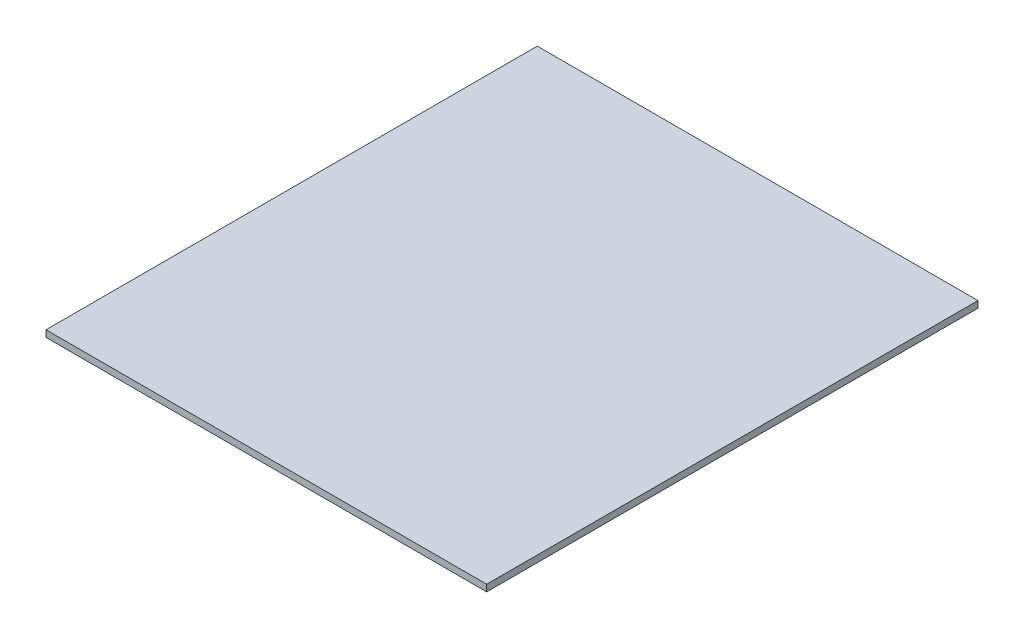
ISO-10303-21;
HEADER;
FILE_DESCRIPTION(('STEP AP214'),'2;1');
FILE_NAME('part.step','',(''),(''),'','','');
FILE_SCHEMA(('AUTOMOTIVE_DESIGN { 1 0 10303 214 1 1 1 1 }'));
ENDSEC;
DATA;
#1=APPLICATION_CONTEXT('core data for automotive mechanical design processes');
#2=APPLICATION_PROTOCOL_DEFINITION('international standard','automotive_design',2000,#1);
#3=PRODUCT_CONTEXT('',#1,'mechanical');
#4=PRODUCT('Part','Part','',(#3));
#5=PRODUCT_RELATED_PRODUCT_CATEGORY('part','',(#4));
#6=PRODUCT_DEFINITION_FORMATION('','',#4);
#7=PRODUCT_DEFINITION_CONTEXT('part definition',#1,'design');
#8=PRODUCT_DEFINITION('design','',#6,#7);
#9=PRODUCT_DEFINITION_SHAPE('','',#8);
#10=(LENGTH_UNIT() NAMED_UNIT(*) SI_UNIT(.MILLI.,.METRE.));
#11=(NAMED_UNIT(*) PLANE_ANGLE_UNIT() SI_UNIT($,.RADIAN.));
#12=(NAMED_UNIT(*) SI_UNIT($,.STERADIAN.) SOLID_ANGLE_UNIT());
#13=UNCERTAINTY_MEASURE_WITH_UNIT(LENGTH_MEASURE(1.E-05),#10,'distance_accuracy_value','');
#14=(GEOMETRIC_REPRESENTATION_CONTEXT(3) GLOBAL_UNCERTAINTY_ASSIGNED_CONTEXT((#13)) GLOBAL_UNIT_ASSIGNED_CONTEXT((#10,
#11,#12)) REPRESENTATION_CONTEXT('',''));
#15=CARTESIAN_POINT('',(0.,0.,0.));
#16=DIRECTION('',(0.,0.,1.));
#17=DIRECTION('',(1.,0.,0.));
#18=AXIS2_PLACEMENT_3D('',#15,#16,#17);
#19=CARTESIAN_POINT('',(331.,-10.,369.));
#20=DIRECTION('',(1.,0.,0.));
#21=DIRECTION('',(0.,0.,-1.));
#22=AXIS2_PLACEMENT_3D('',#19,#20,#21);
#23=PLANE('',#22);
#24=DIRECTION('',(0.,0.,-1.));
#25=VECTOR('',#24,1.);
#26=CARTESIAN_POINT('',(331.,0.,369.));
#27=LINE('',#26,#25);
#28=CARTESIAN_POINT('',(331.,0.,369.));
#29=VERTEX_POINT('',#28);
#30=CARTESIAN_POINT('',(331.,0.,-369.));
#31=VERTEX_POINT('',#30);
#32=EDGE_CURVE('E97',#29,#31,#27,.T.);
#33=ORIENTED_EDGE('',*,*,#32,.F.);
#34=DIRECTION('',(0.,1.,0.));
#35=VECTOR('',#34,1.);
#36=CARTESIAN_POINT('',(331.,-10.,369.));
#37=LINE('',#36,#35);
#38=CARTESIAN_POINT('',(331.,-10.,369.));
#39=VERTEX_POINT('',#38);
#40=EDGE_CURVE('E11',#39,#29,#37,.T.);
#41=ORIENTED_EDGE('',*,*,#40,.F.);
#42=DIRECTION('',(0.,0.,-1.));
#43=VECTOR('',#42,1.);
#44=CARTESIAN_POINT('',(331.,-10.,369.));
#45=LINE('',#44,#43);
#46=CARTESIAN_POINT('',(331.,-10.,-369.));
#47=VERTEX_POINT('',#46);
#48=EDGE_CURVE('E91',#39,#47,#45,.T.);
#49=ORIENTED_EDGE('',*,*,#48,.T.);
#50=DIRECTION('',(0.,1.,0.));
#51=VECTOR('',#50,1.);
#52=CARTESIAN_POINT('',(331.,-10.,-369.));
#53=LINE('',#52,#51);
#54=EDGE_CURVE('E36',#47,#31,#53,.T.);
#55=ORIENTED_EDGE('',*,*,#54,.T.);
#56=EDGE_LOOP('',(#33,#41,#49,#55));
#57=FACE_BOUND('',#56,.T.);
#58=ADVANCED_FACE('F33',(#57),#23,.T.);
#59=CARTESIAN_POINT('',(-331.,-10.,369.));
#60=DIRECTION('',(0.,0.,1.));
#61=DIRECTION('',(1.,0.,0.));
#62=AXIS2_PLACEMENT_3D('',#59,#60,#61);
#63=PLANE('',#62);
#64=DIRECTION('',(1.,0.,0.));
#65=VECTOR('',#64,1.);
#66=CARTESIAN_POINT('',(-331.,0.,369.));
#67=LINE('',#66,#65);
#68=CARTESIAN_POINT('',(-331.,0.,369.));
#69=VERTEX_POINT('',#68);
#70=EDGE_CURVE('E93',#69,#29,#67,.T.);
#71=ORIENTED_EDGE('',*,*,#70,.F.);
#72=DIRECTION('',(0.,1.,0.));
#73=VECTOR('',#72,1.);
#74=CARTESIAN_POINT('',(-331.,-10.,369.));
#75=LINE('',#74,#73);
#76=CARTESIAN_POINT('',(-331.,-10.,369.));
#77=VERTEX_POINT('',#76);
#78=EDGE_CURVE('E42',#77,#69,#75,.T.);
#79=ORIENTED_EDGE('',*,*,#78,.F.);
#80=DIRECTION('',(1.,0.,0.));
#81=VECTOR('',#80,1.);
#82=CARTESIAN_POINT('',(-331.,-10.,369.));
#83=LINE('',#82,#81);
#84=EDGE_CURVE('E88',#77,#39,#83,.T.);
#85=ORIENTED_EDGE('',*,*,#84,.T.);
#86=ORIENTED_EDGE('',*,*,#40,.T.);
#87=EDGE_LOOP('',(#71,#79,#85,#86));
#88=FACE_BOUND('',#87,.T.);
#89=ADVANCED_FACE('F107',(#88),#63,.T.);
#90=CARTESIAN_POINT('',(-331.,-10.,369.));
#91=DIRECTION('',(-1.,0.,0.));
#92=DIRECTION('',(0.,0.,1.));
#93=AXIS2_PLACEMENT_3D('',#90,#91,#92);
#94=PLANE('',#93);
#95=DIRECTION('',(0.,0.,1.));
#96=VECTOR('',#95,1.);
#97=CARTESIAN_POINT('',(-331.,0.,369.));
#98=LINE('',#97,#96);
#99=CARTESIAN_POINT('',(-331.,0.,-369.));
#100=VERTEX_POINT('',#99);
#101=EDGE_CURVE('E83',#100,#69,#98,.T.);
#102=ORIENTED_EDGE('',*,*,#101,.F.);
#103=DIRECTION('',(0.,1.,0.));
#104=VECTOR('',#103,1.);
#105=CARTESIAN_POINT('',(-331.,-10.,-369.));
#106=LINE('',#105,#104);
#107=CARTESIAN_POINT('',(-331.,-10.,-369.));
#108=VERTEX_POINT('',#107);
#109=EDGE_CURVE('E78',#108,#100,#106,.T.);
#110=ORIENTED_EDGE('',*,*,#109,.F.);
#111=DIRECTION('',(0.,0.,1.));
#112=VECTOR('',#111,1.);
#113=CARTESIAN_POINT('',(-331.,-10.,369.));
#114=LINE('',#113,#112);
#115=EDGE_CURVE('E81',#108,#77,#114,.T.);
#116=ORIENTED_EDGE('',*,*,#115,.T.);
#117=ORIENTED_EDGE('',*,*,#78,.T.);
#118=EDGE_LOOP('',(#102,#110,#116,#117));
#119=FACE_BOUND('',#118,.T.);
#120=ADVANCED_FACE('F80',(#119),#94,.T.);
#121=CARTESIAN_POINT('',(-331.,-10.,-369.));
#122=DIRECTION('',(0.,0.,-1.));
#123=DIRECTION('',(-1.,0.,0.));
#124=AXIS2_PLACEMENT_3D('',#121,#122,#123);
#125=PLANE('',#124);
#126=DIRECTION('',(-1.,0.,0.));
#127=VECTOR('',#126,1.);
#128=CARTESIAN_POINT('',(-331.,0.,-369.));
#129=LINE('',#128,#127);
#130=EDGE_CURVE('E100',#31,#100,#129,.T.);
#131=ORIENTED_EDGE('',*,*,#130,.F.);
#132=ORIENTED_EDGE('',*,*,#54,.F.);
#133=DIRECTION('',(-1.,0.,0.));
#134=VECTOR('',#133,1.);
#135=CARTESIAN_POINT('',(-331.,-10.,-369.));
#136=LINE('',#135,#134);
#137=EDGE_CURVE('E87',#47,#108,#136,.T.);
#138=ORIENTED_EDGE('',*,*,#137,.T.);
#139=ORIENTED_EDGE('',*,*,#109,.T.);
#140=EDGE_LOOP('',(#131,#132,#138,#139));
#141=FACE_BOUND('',#140,.T.);
#142=ADVANCED_FACE('F90',(#141),#125,.T.);
#143=CARTESIAN_POINT('',(0.,-10.,0.));
#144=DIRECTION('',(0.,-1.,0.));
#145=DIRECTION('',(0.,0.,-1.));
#146=AXIS2_PLACEMENT_3D('',#143,#144,#145);
#147=PLANE('',#146);
#148=ORIENTED_EDGE('',*,*,#48,.F.);
#149=ORIENTED_EDGE('',*,*,#84,.F.);
#150=ORIENTED_EDGE('',*,*,#115,.F.);
#151=ORIENTED_EDGE('',*,*,#137,.F.);
#152=EDGE_LOOP('',(#148,#149,#150,#151));
#153=FACE_BOUND('',#152,.T.);
#154=ADVANCED_FACE('F86',(#153),#147,.T.);
#155=CARTESIAN_POINT('',(0.,0.,0.));
#156=DIRECTION('',(0.,-1.,0.));
#157=DIRECTION('',(0.,0.,-1.));
#158=AXIS2_PLACEMENT_3D('',#155,#156,#157);
#159=PLANE('',#158);
#160=ORIENTED_EDGE('',*,*,#32,.T.);
#161=ORIENTED_EDGE('',*,*,#130,.T.);
#162=ORIENTED_EDGE('',*,*,#101,.T.);
#163=ORIENTED_EDGE('',*,*,#70,.T.);
#164=EDGE_LOOP('',(#160,#161,#162,#163));
#165=FACE_BOUND('',#164,.T.);
#166=ADVANCED_FACE('F106',(#165),#159,.F.);
#167=CLOSED_SHELL('',(#58,#89,#120,#142,#154,#166));
#168=MANIFOLD_SOLID_BREP('B2',#167);
#169=ADVANCED_BREP_SHAPE_REPRESENTATION('',(#18,#168),#14);
#170=SHAPE_DEFINITION_REPRESENTATION(#9,#169);
ENDSEC;
END-ISO-10303-21;
